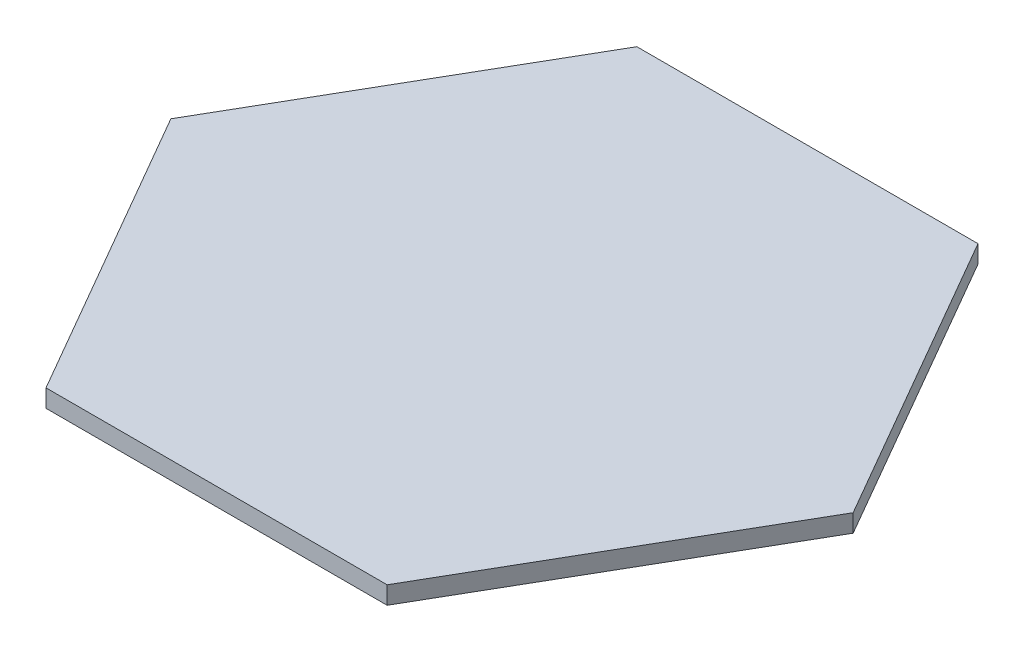
ISO-10303-21;
HEADER;
FILE_DESCRIPTION(('STEP AP214'),'2;1');
FILE_NAME('part.step','',(''),(''),'','','');
FILE_SCHEMA(('AUTOMOTIVE_DESIGN { 1 0 10303 214 1 1 1 1 }'));
ENDSEC;
DATA;
#1=APPLICATION_CONTEXT('core data for automotive mechanical design processes');
#2=APPLICATION_PROTOCOL_DEFINITION('international standard','automotive_design',2000,#1);
#3=PRODUCT_CONTEXT('',#1,'mechanical');
#4=PRODUCT('Part','Part','',(#3));
#5=PRODUCT_RELATED_PRODUCT_CATEGORY('part','',(#4));
#6=PRODUCT_DEFINITION_FORMATION('','',#4);
#7=PRODUCT_DEFINITION_CONTEXT('part definition',#1,'design');
#8=PRODUCT_DEFINITION('design','',#6,#7);
#9=PRODUCT_DEFINITION_SHAPE('','',#8);
#10=(LENGTH_UNIT() NAMED_UNIT(*) SI_UNIT(.MILLI.,.METRE.));
#11=(NAMED_UNIT(*) PLANE_ANGLE_UNIT() SI_UNIT($,.RADIAN.));
#12=(NAMED_UNIT(*) SI_UNIT($,.STERADIAN.) SOLID_ANGLE_UNIT());
#13=UNCERTAINTY_MEASURE_WITH_UNIT(LENGTH_MEASURE(1.E-05),#10,'distance_accuracy_value','');
#14=(GEOMETRIC_REPRESENTATION_CONTEXT(3) GLOBAL_UNCERTAINTY_ASSIGNED_CONTEXT((#13)) GLOBAL_UNIT_ASSIGNED_CONTEXT((#10,
#11,#12)) REPRESENTATION_CONTEXT('',''));
#15=CARTESIAN_POINT('',(0.,0.,0.));
#16=DIRECTION('',(0.,0.,1.));
#17=DIRECTION('',(1.,0.,0.));
#18=AXIS2_PLACEMENT_3D('',#15,#16,#17);
#19=CARTESIAN_POINT('',(31.2786841774372,3.175,51.4762701892219));
#20=DIRECTION('',(-0.866025403784439,0.,-0.5));
#21=DIRECTION('',(-0.5,0.,0.866025403784439));
#22=AXIS2_PLACEMENT_3D('',#19,#20,#21);
#23=PLANE('',#22);
#24=DIRECTION('',(0.5,0.,-0.866025403784439));
#25=VECTOR('',#24,1.);
#26=CARTESIAN_POINT('',(31.2786841774372,0.,51.4762701892219));
#27=LINE('',#26,#25);
#28=CARTESIAN_POINT('',(31.2786841774372,0.,51.4762701892219));
#29=VERTEX_POINT('',#28);
#30=CARTESIAN_POINT('',(61.7779454914684,0.,-1.35000000000003));
#31=VERTEX_POINT('',#30);
#32=EDGE_CURVE('E119',#29,#31,#27,.T.);
#33=ORIENTED_EDGE('',*,*,#32,.T.);
#34=DIRECTION('',(0.,-1.,0.));
#35=VECTOR('',#34,1.);
#36=CARTESIAN_POINT('',(61.7779454914684,3.175,-1.35000000000003));
#37=LINE('',#36,#35);
#38=CARTESIAN_POINT('',(61.7779454914684,3.175,-1.35000000000003));
#39=VERTEX_POINT('',#38);
#40=EDGE_CURVE('E11',#39,#31,#37,.T.);
#41=ORIENTED_EDGE('',*,*,#40,.F.);
#42=DIRECTION('',(0.5,0.,-0.866025403784439));
#43=VECTOR('',#42,1.);
#44=CARTESIAN_POINT('',(31.2786841774372,3.175,51.4762701892219));
#45=LINE('',#44,#43);
#46=CARTESIAN_POINT('',(31.2786841774372,3.175,51.4762701892219));
#47=VERTEX_POINT('',#46);
#48=EDGE_CURVE('E129',#47,#39,#45,.T.);
#49=ORIENTED_EDGE('',*,*,#48,.F.);
#50=DIRECTION('',(0.,-1.,0.));
#51=VECTOR('',#50,1.);
#52=CARTESIAN_POINT('',(31.2786841774372,3.175,51.4762701892219));
#53=LINE('',#52,#51);
#54=EDGE_CURVE('E115',#47,#29,#53,.T.);
#55=ORIENTED_EDGE('',*,*,#54,.T.);
#56=EDGE_LOOP('',(#33,#41,#49,#55));
#57=FACE_BOUND('',#56,.T.);
#58=ADVANCED_FACE('F35',(#57),#23,.F.);
#59=CARTESIAN_POINT('',(61.7779454914684,3.175,-1.35000000000003));
#60=DIRECTION('',(-0.866025403784439,0.,0.5));
#61=DIRECTION('',(0.5,0.,0.866025403784439));
#62=AXIS2_PLACEMENT_3D('',#59,#60,#61);
#63=PLANE('',#62);
#64=DIRECTION('',(-0.5,0.,-0.866025403784439));
#65=VECTOR('',#64,1.);
#66=CARTESIAN_POINT('',(61.7779454914684,0.,-1.35000000000003));
#67=LINE('',#66,#65);
#68=CARTESIAN_POINT('',(31.2786841774372,0.,-54.176270189222));
#69=VERTEX_POINT('',#68);
#70=EDGE_CURVE('E122',#31,#69,#67,.T.);
#71=ORIENTED_EDGE('',*,*,#70,.T.);
#72=DIRECTION('',(0.,-1.,0.));
#73=VECTOR('',#72,1.);
#74=CARTESIAN_POINT('',(31.2786841774372,3.175,-54.176270189222));
#75=LINE('',#74,#73);
#76=CARTESIAN_POINT('',(31.2786841774372,3.175,-54.176270189222));
#77=VERTEX_POINT('',#76);
#78=EDGE_CURVE('E43',#77,#69,#75,.T.);
#79=ORIENTED_EDGE('',*,*,#78,.F.);
#80=DIRECTION('',(-0.5,0.,-0.866025403784439));
#81=VECTOR('',#80,1.);
#82=CARTESIAN_POINT('',(61.7779454914684,3.175,-1.35000000000003));
#83=LINE('',#82,#81);
#84=EDGE_CURVE('E88',#39,#77,#83,.T.);
#85=ORIENTED_EDGE('',*,*,#84,.F.);
#86=ORIENTED_EDGE('',*,*,#40,.T.);
#87=EDGE_LOOP('',(#71,#79,#85,#86));
#88=FACE_BOUND('',#87,.T.);
#89=ADVANCED_FACE('F153',(#88),#63,.F.);
#90=CARTESIAN_POINT('',(31.2786841774372,3.175,-54.176270189222));
#91=DIRECTION('',(0.,0.,1.));
#92=DIRECTION('',(1.,0.,0.));
#93=AXIS2_PLACEMENT_3D('',#90,#91,#92);
#94=PLANE('',#93);
#95=DIRECTION('',(-1.,0.,0.));
#96=VECTOR('',#95,1.);
#97=CARTESIAN_POINT('',(31.2786841774372,0.,-54.176270189222));
#98=LINE('',#97,#96);
#99=CARTESIAN_POINT('',(-29.7198384506252,0.,-54.176270189222));
#100=VERTEX_POINT('',#99);
#101=EDGE_CURVE('E124',#69,#100,#98,.T.);
#102=ORIENTED_EDGE('',*,*,#101,.T.);
#103=DIRECTION('',(0.,-1.,0.));
#104=VECTOR('',#103,1.);
#105=CARTESIAN_POINT('',(-29.7198384506252,3.175,-54.176270189222));
#106=LINE('',#105,#104);
#107=CARTESIAN_POINT('',(-29.7198384506252,3.175,-54.176270189222));
#108=VERTEX_POINT('',#107);
#109=EDGE_CURVE('E110',#108,#100,#106,.T.);
#110=ORIENTED_EDGE('',*,*,#109,.F.);
#111=DIRECTION('',(-1.,0.,0.));
#112=VECTOR('',#111,1.);
#113=CARTESIAN_POINT('',(31.2786841774372,3.175,-54.176270189222));
#114=LINE('',#113,#112);
#115=EDGE_CURVE('E101',#77,#108,#114,.T.);
#116=ORIENTED_EDGE('',*,*,#115,.F.);
#117=ORIENTED_EDGE('',*,*,#78,.T.);
#118=EDGE_LOOP('',(#102,#110,#116,#117));
#119=FACE_BOUND('',#118,.T.);
#120=ADVANCED_FACE('F135',(#119),#94,.F.);
#121=CARTESIAN_POINT('',(-29.7198384506252,3.175,-54.176270189222));
#122=DIRECTION('',(0.866025403784439,0.,0.5));
#123=DIRECTION('',(0.5,0.,-0.866025403784439));
#124=AXIS2_PLACEMENT_3D('',#121,#122,#123);
#125=PLANE('',#124);
#126=DIRECTION('',(-0.5,0.,0.866025403784439));
#127=VECTOR('',#126,1.);
#128=CARTESIAN_POINT('',(-29.7198384506252,0.,-54.176270189222));
#129=LINE('',#128,#127);
#130=CARTESIAN_POINT('',(-60.2190997646564,0.,-1.35000000000001));
#131=VERTEX_POINT('',#130);
#132=EDGE_CURVE('E109',#100,#131,#129,.T.);
#133=ORIENTED_EDGE('',*,*,#132,.T.);
#134=DIRECTION('',(0.,-1.,0.));
#135=VECTOR('',#134,1.);
#136=CARTESIAN_POINT('',(-60.2190997646564,3.175,-1.35000000000001));
#137=LINE('',#136,#135);
#138=CARTESIAN_POINT('',(-60.2190997646564,3.175,-1.35000000000001));
#139=VERTEX_POINT('',#138);
#140=EDGE_CURVE('E106',#139,#131,#137,.T.);
#141=ORIENTED_EDGE('',*,*,#140,.F.);
#142=DIRECTION('',(-0.5,0.,0.866025403784439));
#143=VECTOR('',#142,1.);
#144=CARTESIAN_POINT('',(-29.7198384506252,3.175,-54.176270189222));
#145=LINE('',#144,#143);
#146=EDGE_CURVE('E95',#108,#139,#145,.T.);
#147=ORIENTED_EDGE('',*,*,#146,.F.);
#148=ORIENTED_EDGE('',*,*,#109,.T.);
#149=EDGE_LOOP('',(#133,#141,#147,#148));
#150=FACE_BOUND('',#149,.T.);
#151=ADVANCED_FACE('F107',(#150),#125,.F.);
#152=CARTESIAN_POINT('',(-60.2190997646564,3.175,-1.35000000000001));
#153=DIRECTION('',(0.866025403784439,0.,-0.5));
#154=DIRECTION('',(-0.5,0.,-0.866025403784439));
#155=AXIS2_PLACEMENT_3D('',#152,#153,#154);
#156=PLANE('',#155);
#157=DIRECTION('',(0.5,0.,0.866025403784439));
#158=VECTOR('',#157,1.);
#159=CARTESIAN_POINT('',(-60.2190997646564,0.,-1.35000000000001));
#160=LINE('',#159,#158);
#161=CARTESIAN_POINT('',(-29.7198384506252,0.,51.4762701892219));
#162=VERTEX_POINT('',#161);
#163=EDGE_CURVE('E74',#131,#162,#160,.T.);
#164=ORIENTED_EDGE('',*,*,#163,.T.);
#165=DIRECTION('',(0.,-1.,0.));
#166=VECTOR('',#165,1.);
#167=CARTESIAN_POINT('',(-29.7198384506252,3.175,51.4762701892219));
#168=LINE('',#167,#166);
#169=CARTESIAN_POINT('',(-29.7198384506252,3.175,51.4762701892219));
#170=VERTEX_POINT('',#169);
#171=EDGE_CURVE('E111',#170,#162,#168,.T.);
#172=ORIENTED_EDGE('',*,*,#171,.F.);
#173=DIRECTION('',(0.5,0.,0.866025403784439));
#174=VECTOR('',#173,1.);
#175=CARTESIAN_POINT('',(-60.2190997646564,3.175,-1.35000000000001));
#176=LINE('',#175,#174);
#177=EDGE_CURVE('E99',#139,#170,#176,.T.);
#178=ORIENTED_EDGE('',*,*,#177,.F.);
#179=ORIENTED_EDGE('',*,*,#140,.T.);
#180=EDGE_LOOP('',(#164,#172,#178,#179));
#181=FACE_BOUND('',#180,.T.);
#182=ADVANCED_FACE('F113',(#181),#156,.F.);
#183=CARTESIAN_POINT('',(-29.7198384506252,3.175,51.4762701892219));
#184=DIRECTION('',(0.,0.,-1.));
#185=DIRECTION('',(-1.,0.,0.));
#186=AXIS2_PLACEMENT_3D('',#183,#184,#185);
#187=PLANE('',#186);
#188=DIRECTION('',(1.,0.,0.));
#189=VECTOR('',#188,1.);
#190=CARTESIAN_POINT('',(-29.7198384506252,0.,51.4762701892219));
#191=LINE('',#190,#189);
#192=EDGE_CURVE('E80',#162,#29,#191,.T.);
#193=ORIENTED_EDGE('',*,*,#192,.T.);
#194=ORIENTED_EDGE('',*,*,#54,.F.);
#195=DIRECTION('',(1.,0.,0.));
#196=VECTOR('',#195,1.);
#197=CARTESIAN_POINT('',(-29.7198384506252,3.175,51.4762701892219));
#198=LINE('',#197,#196);
#199=EDGE_CURVE('E51',#170,#47,#198,.T.);
#200=ORIENTED_EDGE('',*,*,#199,.F.);
#201=ORIENTED_EDGE('',*,*,#171,.T.);
#202=EDGE_LOOP('',(#193,#194,#200,#201));
#203=FACE_BOUND('',#202,.T.);
#204=ADVANCED_FACE('F142',(#203),#187,.F.);
#205=CARTESIAN_POINT('',(0.,3.175,0.));
#206=DIRECTION('',(0.,1.,0.));
#207=DIRECTION('',(0.,0.,1.));
#208=AXIS2_PLACEMENT_3D('',#205,#206,#207);
#209=PLANE('',#208);
#210=ORIENTED_EDGE('',*,*,#48,.T.);
#211=ORIENTED_EDGE('',*,*,#84,.T.);
#212=ORIENTED_EDGE('',*,*,#115,.T.);
#213=ORIENTED_EDGE('',*,*,#146,.T.);
#214=ORIENTED_EDGE('',*,*,#177,.T.);
#215=ORIENTED_EDGE('',*,*,#199,.T.);
#216=EDGE_LOOP('',(#210,#211,#212,#213,#214,#215));
#217=FACE_BOUND('',#216,.T.);
#218=ADVANCED_FACE('F97',(#217),#209,.T.);
#219=CARTESIAN_POINT('',(0.,0.,0.));
#220=DIRECTION('',(0.,1.,0.));
#221=DIRECTION('',(0.,0.,1.));
#222=AXIS2_PLACEMENT_3D('',#219,#220,#221);
#223=PLANE('',#222);
#224=ORIENTED_EDGE('',*,*,#32,.F.);
#225=ORIENTED_EDGE('',*,*,#192,.F.);
#226=ORIENTED_EDGE('',*,*,#163,.F.);
#227=ORIENTED_EDGE('',*,*,#132,.F.);
#228=ORIENTED_EDGE('',*,*,#101,.F.);
#229=ORIENTED_EDGE('',*,*,#70,.F.);
#230=EDGE_LOOP('',(#224,#225,#226,#227,#228,#229));
#231=FACE_BOUND('',#230,.T.);
#232=ADVANCED_FACE('F138',(#231),#223,.F.);
#233=CLOSED_SHELL('',(#58,#89,#120,#151,#182,#204,#218,#232));
#234=MANIFOLD_SOLID_BREP('B2',#233);
#235=ADVANCED_BREP_SHAPE_REPRESENTATION('',(#18,#234),#14);
#236=SHAPE_DEFINITION_REPRESENTATION(#9,#235);
ENDSEC;
END-ISO-10303-21;
